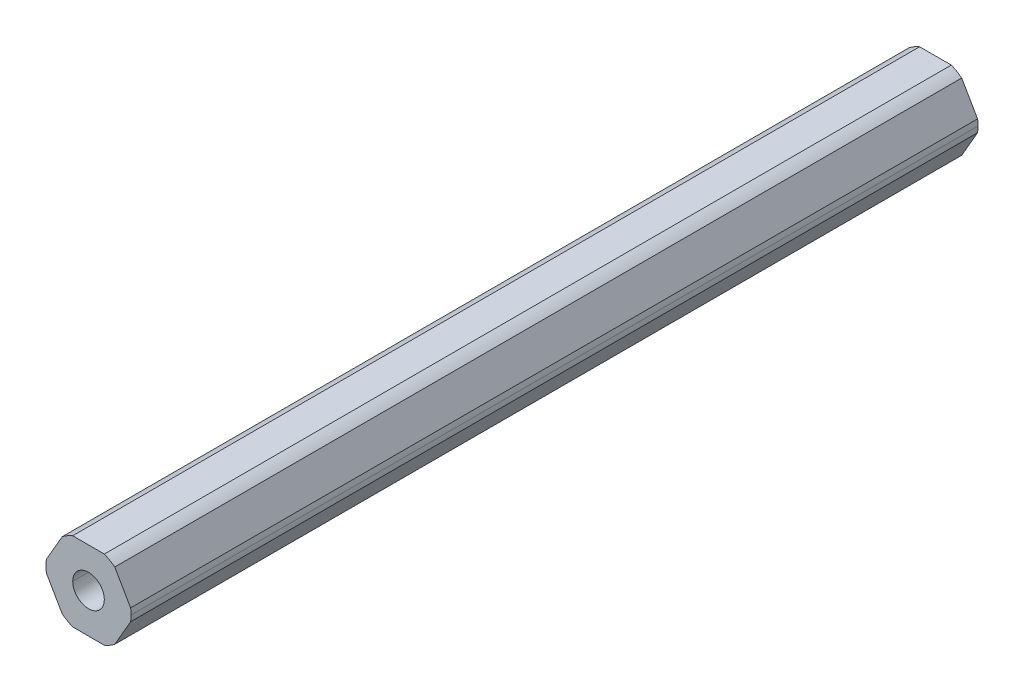
ISO-10303-21;
HEADER;
FILE_DESCRIPTION(('STEP AP214'),'2;1');
FILE_NAME('part.step','',(''),(''),'','','');
FILE_SCHEMA(('AUTOMOTIVE_DESIGN { 1 0 10303 214 1 1 1 1 }'));
ENDSEC;
DATA;
#1=APPLICATION_CONTEXT('core data for automotive mechanical design processes');
#2=APPLICATION_PROTOCOL_DEFINITION('international standard','automotive_design',2000,#1);
#3=PRODUCT_CONTEXT('',#1,'mechanical');
#4=PRODUCT('Part','Part','',(#3));
#5=PRODUCT_RELATED_PRODUCT_CATEGORY('part','',(#4));
#6=PRODUCT_DEFINITION_FORMATION('','',#4);
#7=PRODUCT_DEFINITION_CONTEXT('part definition',#1,'design');
#8=PRODUCT_DEFINITION('design','',#6,#7);
#9=PRODUCT_DEFINITION_SHAPE('','',#8);
#10=(LENGTH_UNIT() NAMED_UNIT(*) SI_UNIT(.MILLI.,.METRE.));
#11=(NAMED_UNIT(*) PLANE_ANGLE_UNIT() SI_UNIT($,.RADIAN.));
#12=(NAMED_UNIT(*) SI_UNIT($,.STERADIAN.) SOLID_ANGLE_UNIT());
#13=UNCERTAINTY_MEASURE_WITH_UNIT(LENGTH_MEASURE(1.E-05),#10,'distance_accuracy_value','');
#14=(GEOMETRIC_REPRESENTATION_CONTEXT(3) GLOBAL_UNCERTAINTY_ASSIGNED_CONTEXT((#13)) GLOBAL_UNIT_ASSIGNED_CONTEXT((#10,
#11,#12)) REPRESENTATION_CONTEXT('',''));
#15=CARTESIAN_POINT('',(0.,0.,0.));
#16=DIRECTION('',(0.,0.,1.));
#17=DIRECTION('',(1.,0.,0.));
#18=AXIS2_PLACEMENT_3D('',#15,#16,#17);
#19=CARTESIAN_POINT('',(0.,0.,-228.6));
#20=DIRECTION('',(0.,0.,1.));
#21=DIRECTION('',(1.,0.,0.));
#22=AXIS2_PLACEMENT_3D('',#19,#20,#21);
#23=CYLINDRICAL_SURFACE('',#22,2.55);
#24=CARTESIAN_POINT('',(0.,0.,-91.850000196));
#25=DIRECTION('',(0.,0.,1.));
#26=DIRECTION('',(1.,0.,0.));
#27=AXIS2_PLACEMENT_3D('',#24,#25,#26);
#28=CIRCLE('',#27,2.55);
#29=CARTESIAN_POINT('',(2.55,0.,-91.850000196));
#30=VERTEX_POINT('',#29);
#31=CARTESIAN_POINT('',(-2.55,0.,-91.850000196));
#32=VERTEX_POINT('',#31);
#33=EDGE_CURVE('E59',#30,#32,#28,.F.);
#34=ORIENTED_EDGE('',*,*,#33,.F.);
#35=DIRECTION('',(0.,0.,1.));
#36=VECTOR('',#35,1.);
#37=CARTESIAN_POINT('',(2.55,0.,-228.6));
#38=LINE('',#37,#36);
#39=CARTESIAN_POINT('',(2.55,0.,-228.6));
#40=VERTEX_POINT('',#39);
#41=EDGE_CURVE('E239',#40,#30,#38,.T.);
#42=ORIENTED_EDGE('',*,*,#41,.F.);
#43=CARTESIAN_POINT('',(0.,0.,-228.6));
#44=DIRECTION('',(0.,0.,1.));
#45=DIRECTION('',(1.,0.,0.));
#46=AXIS2_PLACEMENT_3D('',#43,#44,#45);
#47=CIRCLE('',#46,2.55);
#48=CARTESIAN_POINT('',(-2.55,0.,-228.6));
#49=VERTEX_POINT('',#48);
#50=EDGE_CURVE('E185',#49,#40,#47,.T.);
#51=ORIENTED_EDGE('',*,*,#50,.F.);
#52=DIRECTION('',(0.,0.,1.));
#53=VECTOR('',#52,1.);
#54=CARTESIAN_POINT('',(-2.55,0.,-228.6));
#55=LINE('',#54,#53);
#56=EDGE_CURVE('E46',#49,#32,#55,.T.);
#57=ORIENTED_EDGE('',*,*,#56,.T.);
#58=EDGE_LOOP('',(#34,#42,#51,#57));
#59=FACE_BOUND('',#58,.T.);
#60=ADVANCED_FACE('F38',(#59),#23,.F.);
#61=CARTESIAN_POINT('',(0.,0.,-228.6));
#62=DIRECTION('',(0.,0.,1.));
#63=DIRECTION('',(1.,0.,0.));
#64=AXIS2_PLACEMENT_3D('',#61,#62,#63);
#65=CYLINDRICAL_SURFACE('',#64,6.87);
#66=DIRECTION('',(0.,0.,1.));
#67=VECTOR('',#66,1.);
#68=CARTESIAN_POINT('',(6.87,0.,-228.6));
#69=LINE('',#68,#67);
#70=CARTESIAN_POINT('',(6.87,0.,-228.6));
#71=VERTEX_POINT('',#70);
#72=CARTESIAN_POINT('',(6.87,0.,-91.850000196));
#73=VERTEX_POINT('',#72);
#74=EDGE_CURVE('E237',#71,#73,#69,.T.);
#75=ORIENTED_EDGE('',*,*,#74,.T.);
#76=CARTESIAN_POINT('',(0.,0.,-91.850000196));
#77=DIRECTION('',(0.,0.,1.));
#78=DIRECTION('',(1.,0.,0.));
#79=AXIS2_PLACEMENT_3D('',#76,#77,#78);
#80=CIRCLE('',#79,6.87);
#81=CARTESIAN_POINT('',(6.80102150534208,-0.971085209378955,-91.850000196));
#82=VERTEX_POINT('',#81);
#83=EDGE_CURVE('E160',#82,#73,#80,.T.);
#84=ORIENTED_EDGE('',*,*,#83,.F.);
#85=DIRECTION('',(0.,0.,-1.));
#86=VECTOR('',#85,1.);
#87=CARTESIAN_POINT('',(6.80102150534208,-0.971085209378962,-228.6));
#88=LINE('',#87,#86);
#89=CARTESIAN_POINT('',(6.80102150534208,-0.971085209378955,-228.6));
#90=VERTEX_POINT('',#89);
#91=EDGE_CURVE('E235',#82,#90,#88,.T.);
#92=ORIENTED_EDGE('',*,*,#91,.T.);
#93=CARTESIAN_POINT('',(0.,0.,-228.6));
#94=DIRECTION('',(0.,0.,1.));
#95=DIRECTION('',(1.,0.,0.));
#96=AXIS2_PLACEMENT_3D('',#93,#94,#95);
#97=CIRCLE('',#96,6.87);
#98=EDGE_CURVE('E201',#90,#71,#97,.T.);
#99=ORIENTED_EDGE('',*,*,#98,.T.);
#100=EDGE_LOOP('',(#75,#84,#92,#99));
#101=FACE_BOUND('',#100,.T.);
#102=ADVANCED_FACE('F362',(#101),#65,.T.);
#103=CARTESIAN_POINT('',(3.68083890619154,-6.3754,228.6));
#104=DIRECTION('',(-0.866025403784439,0.5,0.));
#105=DIRECTION('',(0.,0.,1.));
#106=AXIS2_PLACEMENT_3D('',#103,#104,#105);
#107=PLANE('',#106);
#108=DIRECTION('',(0.500000000000001,0.866025403784438,0.));
#109=VECTOR('',#108,1.);
#110=CARTESIAN_POINT('',(4.24149521323254,-5.40431479062105,-91.850000196));
#111=LINE('',#110,#109);
#112=CARTESIAN_POINT('',(4.24149521323254,-5.40431479062105,-91.850000196));
#113=VERTEX_POINT('',#112);
#114=EDGE_CURVE('E305',#113,#82,#111,.T.);
#115=ORIENTED_EDGE('',*,*,#114,.F.);
#116=DIRECTION('',(0.,0.,1.));
#117=VECTOR('',#116,1.);
#118=CARTESIAN_POINT('',(4.24149521323255,-5.40431479062104,-228.6));
#119=LINE('',#118,#117);
#120=CARTESIAN_POINT('',(4.24149521323254,-5.40431479062105,-228.6));
#121=VERTEX_POINT('',#120);
#122=EDGE_CURVE('E179',#121,#113,#119,.T.);
#123=ORIENTED_EDGE('',*,*,#122,.F.);
#124=DIRECTION('',(0.5,0.866025403784439,0.));
#125=VECTOR('',#124,1.);
#126=CARTESIAN_POINT('',(3.68083890619154,-6.3754,-228.6));
#127=LINE('',#126,#125);
#128=EDGE_CURVE('E238',#121,#90,#127,.T.);
#129=ORIENTED_EDGE('',*,*,#128,.T.);
#130=ORIENTED_EDGE('',*,*,#91,.F.);
#131=EDGE_LOOP('',(#115,#123,#129,#130));
#132=FACE_BOUND('',#131,.T.);
#133=ADVANCED_FACE('F332',(#132),#107,.F.);
#134=CARTESIAN_POINT('',(7.36167781238308,0.,228.6));
#135=DIRECTION('',(-0.866025403784439,-0.5,0.));
#136=DIRECTION('',(-0.5,0.866025403784439,0.));
#137=AXIS2_PLACEMENT_3D('',#134,#135,#136);
#138=PLANE('',#137);
#139=DIRECTION('',(-0.5,0.866025403784438,0.));
#140=VECTOR('',#139,1.);
#141=CARTESIAN_POINT('',(6.80102150534208,0.97108520937895,-91.850000196));
#142=LINE('',#141,#140);
#143=CARTESIAN_POINT('',(6.80102150534208,0.97108520937895,-91.850000196));
#144=VERTEX_POINT('',#143);
#145=CARTESIAN_POINT('',(4.24149521323254,5.40431479062105,-91.850000196));
#146=VERTEX_POINT('',#145);
#147=EDGE_CURVE('E53',#144,#146,#142,.T.);
#148=ORIENTED_EDGE('',*,*,#147,.F.);
#149=DIRECTION('',(0.,0.,1.));
#150=VECTOR('',#149,1.);
#151=CARTESIAN_POINT('',(6.80102150534208,0.971085209378949,-228.6));
#152=LINE('',#151,#150);
#153=CARTESIAN_POINT('',(6.80102150534208,0.97108520937895,-228.6));
#154=VERTEX_POINT('',#153);
#155=EDGE_CURVE('E169',#154,#144,#152,.T.);
#156=ORIENTED_EDGE('',*,*,#155,.F.);
#157=DIRECTION('',(-0.5,0.866025403784439,0.));
#158=VECTOR('',#157,1.);
#159=CARTESIAN_POINT('',(7.36167781238308,0.,-228.6));
#160=LINE('',#159,#158);
#161=CARTESIAN_POINT('',(4.24149521323254,5.40431479062105,-228.6));
#162=VERTEX_POINT('',#161);
#163=EDGE_CURVE('E206',#154,#162,#160,.T.);
#164=ORIENTED_EDGE('',*,*,#163,.T.);
#165=DIRECTION('',(0.,0.,-1.));
#166=VECTOR('',#165,1.);
#167=CARTESIAN_POINT('',(4.24149521323254,5.40431479062105,-228.6));
#168=LINE('',#167,#166);
#169=EDGE_CURVE('E171',#146,#162,#168,.T.);
#170=ORIENTED_EDGE('',*,*,#169,.F.);
#171=EDGE_LOOP('',(#148,#156,#164,#170));
#172=FACE_BOUND('',#171,.T.);
#173=ADVANCED_FACE('F167',(#172),#138,.F.);
#174=CARTESIAN_POINT('',(3.68083890619154,6.3754,228.6));
#175=DIRECTION('',(0.,-1.,0.));
#176=DIRECTION('',(0.,0.,-1.));
#177=AXIS2_PLACEMENT_3D('',#174,#175,#176);
#178=PLANE('',#177);
#179=DIRECTION('',(-1.,0.,0.));
#180=VECTOR('',#179,1.);
#181=CARTESIAN_POINT('',(2.55952629210953,6.3754,-91.850000196));
#182=LINE('',#181,#180);
#183=CARTESIAN_POINT('',(2.55952629210953,6.3754,-91.850000196));
#184=VERTEX_POINT('',#183);
#185=CARTESIAN_POINT('',(-2.55952629210953,6.3754,-91.850000196));
#186=VERTEX_POINT('',#185);
#187=EDGE_CURVE('E319',#184,#186,#182,.T.);
#188=ORIENTED_EDGE('',*,*,#187,.F.);
#189=DIRECTION('',(0.,0.,1.));
#190=VECTOR('',#189,1.);
#191=CARTESIAN_POINT('',(2.55952629210952,6.3754,-228.6));
#192=LINE('',#191,#190);
#193=CARTESIAN_POINT('',(2.55952629210952,6.3754,-228.6));
#194=VERTEX_POINT('',#193);
#195=EDGE_CURVE('E243',#194,#184,#192,.T.);
#196=ORIENTED_EDGE('',*,*,#195,.F.);
#197=DIRECTION('',(-1.,0.,0.));
#198=VECTOR('',#197,1.);
#199=CARTESIAN_POINT('',(3.68083890619154,6.3754,-228.6));
#200=LINE('',#199,#198);
#201=CARTESIAN_POINT('',(-2.55952629210953,6.3754,-228.6));
#202=VERTEX_POINT('',#201);
#203=EDGE_CURVE('E202',#194,#202,#200,.T.);
#204=ORIENTED_EDGE('',*,*,#203,.T.);
#205=DIRECTION('',(0.,0.,-1.));
#206=VECTOR('',#205,1.);
#207=CARTESIAN_POINT('',(-2.55952629210953,6.3754,-228.6));
#208=LINE('',#207,#206);
#209=EDGE_CURVE('E230',#186,#202,#208,.T.);
#210=ORIENTED_EDGE('',*,*,#209,.F.);
#211=EDGE_LOOP('',(#188,#196,#204,#210));
#212=FACE_BOUND('',#211,.T.);
#213=ADVANCED_FACE('F323',(#212),#178,.F.);
#214=CARTESIAN_POINT('',(-3.68083890619154,6.3754,228.6));
#215=DIRECTION('',(0.866025403784439,-0.5,0.));
#216=DIRECTION('',(0.,0.,-1.));
#217=AXIS2_PLACEMENT_3D('',#214,#215,#216);
#218=PLANE('',#217);
#219=DIRECTION('',(-0.5,-0.866025403784438,0.));
#220=VECTOR('',#219,1.);
#221=CARTESIAN_POINT('',(-4.24149521323255,5.40431479062105,-91.850000196));
#222=LINE('',#221,#220);
#223=CARTESIAN_POINT('',(-4.24149521323254,5.40431479062105,-91.850000196));
#224=VERTEX_POINT('',#223);
#225=CARTESIAN_POINT('',(-6.80102150534208,0.97108520937896,-91.850000196));
#226=VERTEX_POINT('',#225);
#227=EDGE_CURVE('E290',#224,#226,#222,.T.);
#228=ORIENTED_EDGE('',*,*,#227,.F.);
#229=DIRECTION('',(0.,0.,1.));
#230=VECTOR('',#229,1.);
#231=CARTESIAN_POINT('',(-4.24149521323255,5.40431479062105,-228.6));
#232=LINE('',#231,#230);
#233=CARTESIAN_POINT('',(-4.24149521323255,5.40431479062105,-228.6));
#234=VERTEX_POINT('',#233);
#235=EDGE_CURVE('E257',#234,#224,#232,.T.);
#236=ORIENTED_EDGE('',*,*,#235,.F.);
#237=DIRECTION('',(-0.5,-0.866025403784439,0.));
#238=VECTOR('',#237,1.);
#239=CARTESIAN_POINT('',(-3.68083890619154,6.3754,-228.6));
#240=LINE('',#239,#238);
#241=CARTESIAN_POINT('',(-6.80102150534208,0.97108520937896,-228.6));
#242=VERTEX_POINT('',#241);
#243=EDGE_CURVE('E207',#234,#242,#240,.T.);
#244=ORIENTED_EDGE('',*,*,#243,.T.);
#245=DIRECTION('',(0.,0.,-1.));
#246=VECTOR('',#245,1.);
#247=CARTESIAN_POINT('',(-6.80102150534208,0.97108520937896,-228.6));
#248=LINE('',#247,#246);
#249=EDGE_CURVE('E208',#226,#242,#248,.T.);
#250=ORIENTED_EDGE('',*,*,#249,.F.);
#251=EDGE_LOOP('',(#228,#236,#244,#250));
#252=FACE_BOUND('',#251,.T.);
#253=ADVANCED_FACE('F287',(#252),#218,.F.);
#254=CARTESIAN_POINT('',(-7.36167781238308,0.,228.6));
#255=DIRECTION('',(0.866025403784439,0.5,0.));
#256=DIRECTION('',(0.,0.,-1.));
#257=AXIS2_PLACEMENT_3D('',#254,#255,#256);
#258=PLANE('',#257);
#259=DIRECTION('',(0.5,-0.866025403784439,0.));
#260=VECTOR('',#259,1.);
#261=CARTESIAN_POINT('',(-6.80102150534208,-0.971085209378954,-91.850000196));
#262=LINE('',#261,#260);
#263=CARTESIAN_POINT('',(-6.80102150534208,-0.971085209378951,-91.850000196));
#264=VERTEX_POINT('',#263);
#265=CARTESIAN_POINT('',(-4.24149521323254,-5.40431479062105,-91.850000196));
#266=VERTEX_POINT('',#265);
#267=EDGE_CURVE('E313',#264,#266,#262,.T.);
#268=ORIENTED_EDGE('',*,*,#267,.F.);
#269=DIRECTION('',(0.,0.,1.));
#270=VECTOR('',#269,1.);
#271=CARTESIAN_POINT('',(-6.80102150534208,-0.971085209378962,-228.6));
#272=LINE('',#271,#270);
#273=CARTESIAN_POINT('',(-6.80102150534208,-0.971085209378956,-228.6));
#274=VERTEX_POINT('',#273);
#275=EDGE_CURVE('E226',#274,#264,#272,.T.);
#276=ORIENTED_EDGE('',*,*,#275,.F.);
#277=DIRECTION('',(0.5,-0.866025403784439,0.));
#278=VECTOR('',#277,1.);
#279=CARTESIAN_POINT('',(-7.36167781238308,0.,-228.6));
#280=LINE('',#279,#278);
#281=CARTESIAN_POINT('',(-4.24149521323254,-5.40431479062105,-228.6));
#282=VERTEX_POINT('',#281);
#283=EDGE_CURVE('E221',#274,#282,#280,.T.);
#284=ORIENTED_EDGE('',*,*,#283,.T.);
#285=DIRECTION('',(0.,0.,-1.));
#286=VECTOR('',#285,1.);
#287=CARTESIAN_POINT('',(-4.24149521323255,-5.40431479062104,-228.6));
#288=LINE('',#287,#286);
#289=EDGE_CURVE('E216',#266,#282,#288,.T.);
#290=ORIENTED_EDGE('',*,*,#289,.F.);
#291=EDGE_LOOP('',(#268,#276,#284,#290));
#292=FACE_BOUND('',#291,.T.);
#293=ADVANCED_FACE('F346',(#292),#258,.F.);
#294=CARTESIAN_POINT('',(-3.68083890619154,-6.3754,228.6));
#295=DIRECTION('',(0.,1.,0.));
#296=DIRECTION('',(1.,0.,0.));
#297=AXIS2_PLACEMENT_3D('',#294,#295,#296);
#298=PLANE('',#297);
#299=DIRECTION('',(1.,0.,0.));
#300=VECTOR('',#299,1.);
#301=CARTESIAN_POINT('',(-2.55952629210953,-6.3754,-91.850000196));
#302=LINE('',#301,#300);
#303=CARTESIAN_POINT('',(-2.55952629210953,-6.3754,-91.850000196));
#304=VERTEX_POINT('',#303);
#305=CARTESIAN_POINT('',(2.55952629210953,-6.3754,-91.850000196));
#306=VERTEX_POINT('',#305);
#307=EDGE_CURVE('E309',#304,#306,#302,.T.);
#308=ORIENTED_EDGE('',*,*,#307,.F.);
#309=DIRECTION('',(0.,0.,1.));
#310=VECTOR('',#309,1.);
#311=CARTESIAN_POINT('',(-2.55952629210953,-6.3754,-228.6));
#312=LINE('',#311,#310);
#313=CARTESIAN_POINT('',(-2.55952629210953,-6.3754,-228.6));
#314=VERTEX_POINT('',#313);
#315=EDGE_CURVE('E209',#314,#304,#312,.T.);
#316=ORIENTED_EDGE('',*,*,#315,.F.);
#317=DIRECTION('',(1.,0.,0.));
#318=VECTOR('',#317,1.);
#319=CARTESIAN_POINT('',(-3.68083890619154,-6.3754,-228.6));
#320=LINE('',#319,#318);
#321=CARTESIAN_POINT('',(2.55952629210953,-6.3754,-228.6));
#322=VERTEX_POINT('',#321);
#323=EDGE_CURVE('E217',#314,#322,#320,.T.);
#324=ORIENTED_EDGE('',*,*,#323,.T.);
#325=DIRECTION('',(0.,0.,-1.));
#326=VECTOR('',#325,1.);
#327=CARTESIAN_POINT('',(2.55952629210953,-6.3754,-228.6));
#328=LINE('',#327,#326);
#329=EDGE_CURVE('E189',#306,#322,#328,.T.);
#330=ORIENTED_EDGE('',*,*,#329,.F.);
#331=EDGE_LOOP('',(#308,#316,#324,#330));
#332=FACE_BOUND('',#331,.T.);
#333=ADVANCED_FACE('F350',(#332),#298,.F.);
#334=CARTESIAN_POINT('',(0.,0.,-228.6));
#335=DIRECTION('',(0.,0.,1.));
#336=DIRECTION('',(1.,0.,0.));
#337=AXIS2_PLACEMENT_3D('',#334,#335,#336);
#338=CYLINDRICAL_SURFACE('',#337,6.87);
#339=ORIENTED_EDGE('',*,*,#155,.T.);
#340=EDGE_CURVE('E157',#73,#144,#80,.T.);
#341=ORIENTED_EDGE('',*,*,#340,.F.);
#342=ORIENTED_EDGE('',*,*,#74,.F.);
#343=CARTESIAN_POINT('',(0.,0.,-228.6));
#344=DIRECTION('',(0.,0.,1.));
#345=DIRECTION('',(1.,0.,0.));
#346=AXIS2_PLACEMENT_3D('',#343,#344,#345);
#347=CIRCLE('',#346,6.87);
#348=EDGE_CURVE('E177',#71,#154,#347,.T.);
#349=ORIENTED_EDGE('',*,*,#348,.T.);
#350=EDGE_LOOP('',(#339,#341,#342,#349));
#351=FACE_BOUND('',#350,.T.);
#352=ADVANCED_FACE('F175',(#351),#338,.T.);
#353=CARTESIAN_POINT('',(0.,0.,-228.6));
#354=DIRECTION('',(0.,0.,1.));
#355=DIRECTION('',(1.,0.,0.));
#356=AXIS2_PLACEMENT_3D('',#353,#354,#355);
#357=CYLINDRICAL_SURFACE('',#356,6.87);
#358=ORIENTED_EDGE('',*,*,#122,.T.);
#359=CARTESIAN_POINT('',(0.,0.,-91.850000196));
#360=DIRECTION('',(0.,0.,1.));
#361=DIRECTION('',(1.,0.,0.));
#362=AXIS2_PLACEMENT_3D('',#359,#360,#361);
#363=CIRCLE('',#362,6.87);
#364=EDGE_CURVE('E307',#306,#113,#363,.T.);
#365=ORIENTED_EDGE('',*,*,#364,.F.);
#366=ORIENTED_EDGE('',*,*,#329,.T.);
#367=CARTESIAN_POINT('',(0.,0.,-228.6));
#368=DIRECTION('',(0.,0.,1.));
#369=DIRECTION('',(1.,0.,0.));
#370=AXIS2_PLACEMENT_3D('',#367,#368,#369);
#371=CIRCLE('',#370,6.87);
#372=EDGE_CURVE('E193',#322,#121,#371,.T.);
#373=ORIENTED_EDGE('',*,*,#372,.T.);
#374=EDGE_LOOP('',(#358,#365,#366,#373));
#375=FACE_BOUND('',#374,.T.);
#376=ADVANCED_FACE('F335',(#375),#357,.T.);
#377=CARTESIAN_POINT('',(0.,0.,-228.6));
#378=DIRECTION('',(0.,0.,1.));
#379=DIRECTION('',(1.,0.,0.));
#380=AXIS2_PLACEMENT_3D('',#377,#378,#379);
#381=CYLINDRICAL_SURFACE('',#380,6.87);
#382=ORIENTED_EDGE('',*,*,#315,.T.);
#383=CARTESIAN_POINT('',(0.,0.,-91.850000196));
#384=DIRECTION('',(0.,0.,1.));
#385=DIRECTION('',(1.,0.,0.));
#386=AXIS2_PLACEMENT_3D('',#383,#384,#385);
#387=CIRCLE('',#386,6.87);
#388=EDGE_CURVE('E311',#266,#304,#387,.T.);
#389=ORIENTED_EDGE('',*,*,#388,.F.);
#390=ORIENTED_EDGE('',*,*,#289,.T.);
#391=CARTESIAN_POINT('',(0.,0.,-228.6));
#392=DIRECTION('',(0.,0.,1.));
#393=DIRECTION('',(1.,0.,0.));
#394=AXIS2_PLACEMENT_3D('',#391,#392,#393);
#395=CIRCLE('',#394,6.87);
#396=EDGE_CURVE('E212',#282,#314,#395,.T.);
#397=ORIENTED_EDGE('',*,*,#396,.T.);
#398=EDGE_LOOP('',(#382,#389,#390,#397));
#399=FACE_BOUND('',#398,.T.);
#400=ADVANCED_FACE('F341',(#399),#381,.T.);
#401=CARTESIAN_POINT('',(0.,0.,-228.6));
#402=DIRECTION('',(0.,0.,1.));
#403=DIRECTION('',(1.,0.,0.));
#404=AXIS2_PLACEMENT_3D('',#401,#402,#403);
#405=CYLINDRICAL_SURFACE('',#404,6.87);
#406=ORIENTED_EDGE('',*,*,#275,.T.);
#407=CARTESIAN_POINT('',(0.,0.,-91.850000196));
#408=DIRECTION('',(0.,0.,1.));
#409=DIRECTION('',(1.,0.,0.));
#410=AXIS2_PLACEMENT_3D('',#407,#408,#409);
#411=CIRCLE('',#410,6.87);
#412=EDGE_CURVE('E315',#226,#264,#411,.T.);
#413=ORIENTED_EDGE('',*,*,#412,.F.);
#414=ORIENTED_EDGE('',*,*,#249,.T.);
#415=CARTESIAN_POINT('',(0.,0.,-228.6));
#416=DIRECTION('',(0.,0.,1.));
#417=DIRECTION('',(1.,0.,0.));
#418=AXIS2_PLACEMENT_3D('',#415,#416,#417);
#419=CIRCLE('',#418,6.87);
#420=EDGE_CURVE('E210',#242,#274,#419,.T.);
#421=ORIENTED_EDGE('',*,*,#420,.T.);
#422=EDGE_LOOP('',(#406,#413,#414,#421));
#423=FACE_BOUND('',#422,.T.);
#424=ADVANCED_FACE('F348',(#423),#405,.T.);
#425=CARTESIAN_POINT('',(0.,0.,-228.6));
#426=DIRECTION('',(0.,0.,1.));
#427=DIRECTION('',(1.,0.,0.));
#428=AXIS2_PLACEMENT_3D('',#425,#426,#427);
#429=CYLINDRICAL_SURFACE('',#428,6.87);
#430=ORIENTED_EDGE('',*,*,#235,.T.);
#431=CARTESIAN_POINT('',(0.,0.,-91.850000196));
#432=DIRECTION('',(0.,0.,1.));
#433=DIRECTION('',(1.,0.,0.));
#434=AXIS2_PLACEMENT_3D('',#431,#432,#433);
#435=CIRCLE('',#434,6.87);
#436=EDGE_CURVE('E281',#186,#224,#435,.T.);
#437=ORIENTED_EDGE('',*,*,#436,.F.);
#438=ORIENTED_EDGE('',*,*,#209,.T.);
#439=CARTESIAN_POINT('',(0.,0.,-228.6));
#440=DIRECTION('',(0.,0.,1.));
#441=DIRECTION('',(1.,0.,0.));
#442=AXIS2_PLACEMENT_3D('',#439,#440,#441);
#443=CIRCLE('',#442,6.87);
#444=EDGE_CURVE('E253',#202,#234,#443,.T.);
#445=ORIENTED_EDGE('',*,*,#444,.T.);
#446=EDGE_LOOP('',(#430,#437,#438,#445));
#447=FACE_BOUND('',#446,.T.);
#448=ADVANCED_FACE('F280',(#447),#429,.T.);
#449=CARTESIAN_POINT('',(0.,0.,-228.6));
#450=DIRECTION('',(0.,0.,1.));
#451=DIRECTION('',(1.,0.,0.));
#452=AXIS2_PLACEMENT_3D('',#449,#450,#451);
#453=CYLINDRICAL_SURFACE('',#452,6.87);
#454=ORIENTED_EDGE('',*,*,#195,.T.);
#455=CARTESIAN_POINT('',(0.,0.,-91.850000196));
#456=DIRECTION('',(0.,0.,1.));
#457=DIRECTION('',(1.,0.,0.));
#458=AXIS2_PLACEMENT_3D('',#455,#456,#457);
#459=CIRCLE('',#458,6.87);
#460=EDGE_CURVE('E172',#146,#184,#459,.T.);
#461=ORIENTED_EDGE('',*,*,#460,.F.);
#462=ORIENTED_EDGE('',*,*,#169,.T.);
#463=CARTESIAN_POINT('',(0.,0.,-228.6));
#464=DIRECTION('',(0.,0.,1.));
#465=DIRECTION('',(1.,0.,0.));
#466=AXIS2_PLACEMENT_3D('',#463,#464,#465);
#467=CIRCLE('',#466,6.87);
#468=EDGE_CURVE('E259',#162,#194,#467,.T.);
#469=ORIENTED_EDGE('',*,*,#468,.T.);
#470=EDGE_LOOP('',(#454,#461,#462,#469));
#471=FACE_BOUND('',#470,.T.);
#472=ADVANCED_FACE('F374',(#471),#453,.T.);
#473=CARTESIAN_POINT('',(0.,0.,-228.6));
#474=DIRECTION('',(0.,0.,1.));
#475=DIRECTION('',(1.,0.,0.));
#476=AXIS2_PLACEMENT_3D('',#473,#474,#475);
#477=CYLINDRICAL_SURFACE('',#476,2.55);
#478=CARTESIAN_POINT('',(0.,0.,-91.850000196));
#479=DIRECTION('',(0.,0.,1.));
#480=DIRECTION('',(1.,0.,0.));
#481=AXIS2_PLACEMENT_3D('',#478,#479,#480);
#482=CIRCLE('',#481,2.55);
#483=EDGE_CURVE('E11',#32,#30,#482,.F.);
#484=ORIENTED_EDGE('',*,*,#483,.F.);
#485=ORIENTED_EDGE('',*,*,#56,.F.);
#486=CARTESIAN_POINT('',(0.,0.,-228.6));
#487=DIRECTION('',(0.,0.,1.));
#488=DIRECTION('',(1.,0.,0.));
#489=AXIS2_PLACEMENT_3D('',#486,#487,#488);
#490=CIRCLE('',#489,2.55);
#491=EDGE_CURVE('E197',#40,#49,#490,.T.);
#492=ORIENTED_EDGE('',*,*,#491,.F.);
#493=ORIENTED_EDGE('',*,*,#41,.T.);
#494=EDGE_LOOP('',(#484,#485,#492,#493));
#495=FACE_BOUND('',#494,.T.);
#496=ADVANCED_FACE('F375',(#495),#477,.F.);
#497=CARTESIAN_POINT('',(0.,0.,-228.6));
#498=DIRECTION('',(0.,0.,1.));
#499=DIRECTION('',(1.,0.,0.));
#500=AXIS2_PLACEMENT_3D('',#497,#498,#499);
#501=PLANE('',#500);
#502=ORIENTED_EDGE('',*,*,#468,.F.);
#503=ORIENTED_EDGE('',*,*,#163,.F.);
#504=ORIENTED_EDGE('',*,*,#348,.F.);
#505=ORIENTED_EDGE('',*,*,#98,.F.);
#506=ORIENTED_EDGE('',*,*,#128,.F.);
#507=ORIENTED_EDGE('',*,*,#372,.F.);
#508=ORIENTED_EDGE('',*,*,#323,.F.);
#509=ORIENTED_EDGE('',*,*,#396,.F.);
#510=ORIENTED_EDGE('',*,*,#283,.F.);
#511=ORIENTED_EDGE('',*,*,#420,.F.);
#512=ORIENTED_EDGE('',*,*,#243,.F.);
#513=ORIENTED_EDGE('',*,*,#444,.F.);
#514=ORIENTED_EDGE('',*,*,#203,.F.);
#515=EDGE_LOOP('',(#502,#503,#504,#505,#506,#507,#508,#509,#510,#511,#512,#513,#514));
#516=FACE_BOUND('',#515,.T.);
#517=ORIENTED_EDGE('',*,*,#491,.T.);
#518=ORIENTED_EDGE('',*,*,#50,.T.);
#519=EDGE_LOOP('',(#517,#518));
#520=FACE_BOUND('',#519,.T.);
#521=ADVANCED_FACE('F40',(#516,#520),#501,.F.);
#522=CARTESIAN_POINT('',(0.,0.,-91.850000196));
#523=DIRECTION('',(0.,0.,1.));
#524=DIRECTION('',(1.,0.,0.));
#525=AXIS2_PLACEMENT_3D('',#522,#523,#524);
#526=PLANE('',#525);
#527=ORIENTED_EDGE('',*,*,#83,.T.);
#528=ORIENTED_EDGE('',*,*,#340,.T.);
#529=ORIENTED_EDGE('',*,*,#147,.T.);
#530=ORIENTED_EDGE('',*,*,#460,.T.);
#531=ORIENTED_EDGE('',*,*,#187,.T.);
#532=ORIENTED_EDGE('',*,*,#436,.T.);
#533=ORIENTED_EDGE('',*,*,#227,.T.);
#534=ORIENTED_EDGE('',*,*,#412,.T.);
#535=ORIENTED_EDGE('',*,*,#267,.T.);
#536=ORIENTED_EDGE('',*,*,#388,.T.);
#537=ORIENTED_EDGE('',*,*,#307,.T.);
#538=ORIENTED_EDGE('',*,*,#364,.T.);
#539=ORIENTED_EDGE('',*,*,#114,.T.);
#540=EDGE_LOOP('',(#527,#528,#529,#530,#531,#532,#533,#534,#535,#536,#537,#538,#539));
#541=FACE_BOUND('',#540,.T.);
#542=ORIENTED_EDGE('',*,*,#33,.T.);
#543=ORIENTED_EDGE('',*,*,#483,.T.);
#544=EDGE_LOOP('',(#542,#543));
#545=FACE_BOUND('',#544,.T.);
#546=ADVANCED_FACE('F158',(#541,#545),#526,.T.);
#547=CLOSED_SHELL('',(#60,#102,#133,#173,#213,#253,#293,#333,#352,#376,#400,#424,#448,#472,#496,
#521,#546));
#548=MANIFOLD_SOLID_BREP('B2',#547);
#549=ADVANCED_BREP_SHAPE_REPRESENTATION('',(#18,#548),#14);
#550=SHAPE_DEFINITION_REPRESENTATION(#9,#549);
ENDSEC;
END-ISO-10303-21;
